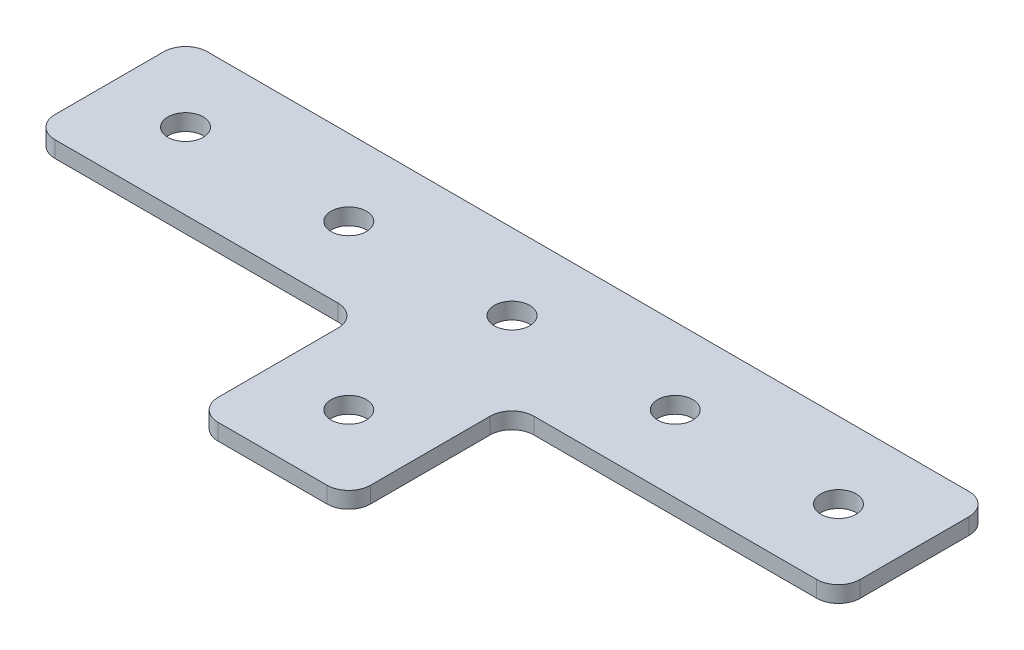
ISO-10303-21;
HEADER;
FILE_DESCRIPTION(('STEP AP214'),'2;1');
FILE_NAME('part.step','',(''),(''),'','','');
FILE_SCHEMA(('AUTOMOTIVE_DESIGN { 1 0 10303 214 1 1 1 1 }'));
ENDSEC;
DATA;
#1=APPLICATION_CONTEXT('core data for automotive mechanical design processes');
#2=APPLICATION_PROTOCOL_DEFINITION('international standard','automotive_design',2000,#1);
#3=PRODUCT_CONTEXT('',#1,'mechanical');
#4=PRODUCT('Part','Part','',(#3));
#5=PRODUCT_RELATED_PRODUCT_CATEGORY('part','',(#4));
#6=PRODUCT_DEFINITION_FORMATION('','',#4);
#7=PRODUCT_DEFINITION_CONTEXT('part definition',#1,'design');
#8=PRODUCT_DEFINITION('design','',#6,#7);
#9=PRODUCT_DEFINITION_SHAPE('','',#8);
#10=(LENGTH_UNIT() NAMED_UNIT(*) SI_UNIT(.MILLI.,.METRE.));
#11=(NAMED_UNIT(*) PLANE_ANGLE_UNIT() SI_UNIT($,.RADIAN.));
#12=(NAMED_UNIT(*) SI_UNIT($,.STERADIAN.) SOLID_ANGLE_UNIT());
#13=UNCERTAINTY_MEASURE_WITH_UNIT(LENGTH_MEASURE(1.E-05),#10,'distance_accuracy_value','');
#14=(GEOMETRIC_REPRESENTATION_CONTEXT(3) GLOBAL_UNCERTAINTY_ASSIGNED_CONTEXT((#13)) GLOBAL_UNIT_ASSIGNED_CONTEXT((#10,
#11,#12)) REPRESENTATION_CONTEXT('',''));
#15=CARTESIAN_POINT('',(0.,0.,0.));
#16=DIRECTION('',(0.,0.,1.));
#17=DIRECTION('',(1.,0.,0.));
#18=AXIS2_PLACEMENT_3D('',#15,#16,#17);
#19=CARTESIAN_POINT('',(-1.3162117550678,1.30807034319605,-8.24152412122426));
#20=DIRECTION('',(0.,-1.,0.));
#21=DIRECTION('',(0.,0.,-1.));
#22=AXIS2_PLACEMENT_3D('',#19,#20,#21);
#23=PLANE('',#22);
#24=CARTESIAN_POINT('',(-1.3162117550678,1.30807034319605,-8.24152412122426));
#25=DIRECTION('',(0.,1.,0.));
#26=DIRECTION('',(0.,0.,1.));
#27=AXIS2_PLACEMENT_3D('',#24,#25,#26);
#28=CIRCLE('',#27,1.625);
#29=CARTESIAN_POINT('',(-1.3162117550678,1.30807034319605,-6.61652412122426));
#30=VERTEX_POINT('',#29);
#31=EDGE_CURVE('E276',#30,#30,#28,.T.);
#32=ORIENTED_EDGE('',*,*,#31,.T.);
#33=EDGE_LOOP('',(#32));
#34=FACE_BOUND('',#33,.T.);
#35=DIRECTION('',(0.,0.,-1.));
#36=VECTOR('',#35,1.);
#37=CARTESIAN_POINT('',(5.6837882449323,1.30807034319605,13.7584758787757));
#38=LINE('',#37,#36);
#39=CARTESIAN_POINT('',(5.6837882449323,1.30807034319605,11.7584758787757));
#40=VERTEX_POINT('',#39);
#41=CARTESIAN_POINT('',(5.6837882449323,1.30807034319605,0.758475878775776));
#42=VERTEX_POINT('',#41);
#43=EDGE_CURVE('E158',#40,#42,#38,.T.);
#44=ORIENTED_EDGE('',*,*,#43,.F.);
#45=CARTESIAN_POINT('',(3.6837882449323,1.30807034319605,11.7584758787757));
#46=DIRECTION('',(0.,-1.,0.));
#47=DIRECTION('',(0.,0.,-1.));
#48=AXIS2_PLACEMENT_3D('',#45,#46,#47);
#49=CIRCLE('',#48,2.);
#50=CARTESIAN_POINT('',(3.6837882449323,1.30807034319605,13.7584758787757));
#51=VERTEX_POINT('',#50);
#52=EDGE_CURVE('E187',#40,#51,#49,.T.);
#53=ORIENTED_EDGE('',*,*,#52,.T.);
#54=DIRECTION('',(1.,0.,0.));
#55=VECTOR('',#54,1.);
#56=CARTESIAN_POINT('',(-8.31621175506789,1.30807034319605,13.7584758787757));
#57=LINE('',#56,#55);
#58=CARTESIAN_POINT('',(-6.31621175506789,1.30807034319605,13.7584758787757));
#59=VERTEX_POINT('',#58);
#60=EDGE_CURVE('E162',#59,#51,#57,.T.);
#61=ORIENTED_EDGE('',*,*,#60,.F.);
#62=CARTESIAN_POINT('',(-6.31621175506789,1.30807034319605,11.7584758787757));
#63=DIRECTION('',(0.,-1.,0.));
#64=DIRECTION('',(0.,0.,-1.));
#65=AXIS2_PLACEMENT_3D('',#62,#63,#64);
#66=CIRCLE('',#65,2.);
#67=CARTESIAN_POINT('',(-8.31621175506789,1.30807034319605,11.7584758787757));
#68=VERTEX_POINT('',#67);
#69=EDGE_CURVE('E157',#59,#68,#66,.T.);
#70=ORIENTED_EDGE('',*,*,#69,.T.);
#71=DIRECTION('',(0.,0.,-1.));
#72=VECTOR('',#71,1.);
#73=CARTESIAN_POINT('',(-8.31621175506789,1.30807034319605,13.7584758787757));
#74=LINE('',#73,#72);
#75=CARTESIAN_POINT('',(-8.31621175506789,1.30807034319605,0.758475878775778));
#76=VERTEX_POINT('',#75);
#77=EDGE_CURVE('E240',#68,#76,#74,.T.);
#78=ORIENTED_EDGE('',*,*,#77,.T.);
#79=CARTESIAN_POINT('',(-10.3162117550679,1.30807034319605,0.758475878775778));
#80=DIRECTION('',(0.,-1.,0.));
#81=DIRECTION('',(0.,0.,-1.));
#82=AXIS2_PLACEMENT_3D('',#79,#80,#81);
#83=CIRCLE('',#82,2.);
#84=CARTESIAN_POINT('',(-10.3162117550679,1.30807034319605,-1.24152412122422));
#85=VERTEX_POINT('',#84);
#86=EDGE_CURVE('E10',#76,#85,#83,.F.);
#87=ORIENTED_EDGE('',*,*,#86,.T.);
#88=DIRECTION('',(-1.,0.,0.));
#89=VECTOR('',#88,1.);
#90=CARTESIAN_POINT('',(-8.31621175506789,1.30807034319605,-1.24152412122422));
#91=LINE('',#90,#89);
#92=CARTESIAN_POINT('',(-36.3162117550677,1.30807034319605,-1.24152412122422));
#93=VERTEX_POINT('',#92);
#94=EDGE_CURVE('E230',#85,#93,#91,.T.);
#95=ORIENTED_EDGE('',*,*,#94,.T.);
#96=CARTESIAN_POINT('',(-36.3162117550677,1.30807034319605,-3.24152412122422));
#97=DIRECTION('',(0.,-1.,0.));
#98=DIRECTION('',(0.,0.,-1.));
#99=AXIS2_PLACEMENT_3D('',#96,#97,#98);
#100=CIRCLE('',#99,2.);
#101=CARTESIAN_POINT('',(-38.3162117550677,1.30807034319605,-3.24152412122421));
#102=VERTEX_POINT('',#101);
#103=EDGE_CURVE('E179',#93,#102,#100,.T.);
#104=ORIENTED_EDGE('',*,*,#103,.T.);
#105=DIRECTION('',(0.,0.,-1.));
#106=VECTOR('',#105,1.);
#107=CARTESIAN_POINT('',(-38.3162117550677,1.30807034319605,-1.24152412122422));
#108=LINE('',#107,#106);
#109=CARTESIAN_POINT('',(-38.3162117550677,1.30807034319605,-13.2415241212243));
#110=VERTEX_POINT('',#109);
#111=EDGE_CURVE('E244',#102,#110,#108,.T.);
#112=ORIENTED_EDGE('',*,*,#111,.T.);
#113=CARTESIAN_POINT('',(-36.3162117550677,1.30807034319605,-13.2415241212243));
#114=DIRECTION('',(0.,-1.,0.));
#115=DIRECTION('',(0.,0.,-1.));
#116=AXIS2_PLACEMENT_3D('',#113,#114,#115);
#117=CIRCLE('',#116,2.);
#118=CARTESIAN_POINT('',(-36.3162117550677,1.30807034319605,-15.2415241212243));
#119=VERTEX_POINT('',#118);
#120=EDGE_CURVE('E182',#110,#119,#117,.T.);
#121=ORIENTED_EDGE('',*,*,#120,.T.);
#122=DIRECTION('',(-1.,0.,0.));
#123=VECTOR('',#122,1.);
#124=CARTESIAN_POINT('',(35.6837882449321,1.30807034319605,-15.2415241212243));
#125=LINE('',#124,#123);
#126=CARTESIAN_POINT('',(33.6837882449321,1.30807034319605,-15.2415241212243));
#127=VERTEX_POINT('',#126);
#128=EDGE_CURVE('E287',#127,#119,#125,.T.);
#129=ORIENTED_EDGE('',*,*,#128,.F.);
#130=CARTESIAN_POINT('',(33.6837882449321,1.30807034319605,-13.2415241212243));
#131=DIRECTION('',(0.,-1.,0.));
#132=DIRECTION('',(0.,0.,-1.));
#133=AXIS2_PLACEMENT_3D('',#130,#131,#132);
#134=CIRCLE('',#133,2.);
#135=CARTESIAN_POINT('',(35.6837882449321,1.30807034319605,-13.2415241212243));
#136=VERTEX_POINT('',#135);
#137=EDGE_CURVE('E184',#127,#136,#134,.T.);
#138=ORIENTED_EDGE('',*,*,#137,.T.);
#139=DIRECTION('',(0.,0.,-1.));
#140=VECTOR('',#139,1.);
#141=CARTESIAN_POINT('',(35.6837882449321,1.30807034319605,-1.24152412122422));
#142=LINE('',#141,#140);
#143=CARTESIAN_POINT('',(35.6837882449321,1.30807034319605,-3.24152412122422));
#144=VERTEX_POINT('',#143);
#145=EDGE_CURVE('E284',#144,#136,#142,.T.);
#146=ORIENTED_EDGE('',*,*,#145,.F.);
#147=CARTESIAN_POINT('',(33.6837882449321,1.30807034319605,-3.24152412122422));
#148=DIRECTION('',(0.,-1.,0.));
#149=DIRECTION('',(0.,0.,-1.));
#150=AXIS2_PLACEMENT_3D('',#147,#148,#149);
#151=CIRCLE('',#150,2.);
#152=CARTESIAN_POINT('',(33.6837882449321,1.30807034319605,-1.24152412122422));
#153=VERTEX_POINT('',#152);
#154=EDGE_CURVE('E31',#144,#153,#151,.T.);
#155=ORIENTED_EDGE('',*,*,#154,.T.);
#156=DIRECTION('',(1.,0.,0.));
#157=VECTOR('',#156,1.);
#158=CARTESIAN_POINT('',(5.6837882449323,1.30807034319605,-1.24152412122422));
#159=LINE('',#158,#157);
#160=CARTESIAN_POINT('',(7.6837882449323,1.30807034319605,-1.24152412122422));
#161=VERTEX_POINT('',#160);
#162=EDGE_CURVE('E282',#161,#153,#159,.T.);
#163=ORIENTED_EDGE('',*,*,#162,.F.);
#164=CARTESIAN_POINT('',(7.6837882449323,1.30807034319605,0.758475878775776));
#165=DIRECTION('',(0.,-1.,0.));
#166=DIRECTION('',(0.,0.,-1.));
#167=AXIS2_PLACEMENT_3D('',#164,#165,#166);
#168=CIRCLE('',#167,2.);
#169=EDGE_CURVE('E219',#161,#42,#168,.F.);
#170=ORIENTED_EDGE('',*,*,#169,.T.);
#171=EDGE_LOOP('',(#44,#53,#61,#70,#78,#87,#95,#104,#112,#121,#129,#138,#146,#155,#163,#170));
#172=FACE_BOUND('',#171,.T.);
#173=CARTESIAN_POINT('',(-1.31621175506781,1.30807034319605,6.75847587877574));
#174=DIRECTION('',(0.,1.,0.));
#175=DIRECTION('',(0.,0.,1.));
#176=AXIS2_PLACEMENT_3D('',#173,#174,#175);
#177=CIRCLE('',#176,1.625);
#178=CARTESIAN_POINT('',(-1.31621175506781,1.30807034319605,8.38347587877574));
#179=VERTEX_POINT('',#178);
#180=EDGE_CURVE('E264',#179,#179,#177,.T.);
#181=ORIENTED_EDGE('',*,*,#180,.T.);
#182=EDGE_LOOP('',(#181));
#183=FACE_BOUND('',#182,.T.);
#184=CARTESIAN_POINT('',(28.6837882449322,1.30807034319605,-8.24152412122426));
#185=DIRECTION('',(0.,1.,0.));
#186=DIRECTION('',(0.,0.,1.));
#187=AXIS2_PLACEMENT_3D('',#184,#185,#186);
#188=CIRCLE('',#187,1.625);
#189=CARTESIAN_POINT('',(28.6837882449322,1.30807034319605,-6.61652412122426));
#190=VERTEX_POINT('',#189);
#191=EDGE_CURVE('E258',#190,#190,#188,.T.);
#192=ORIENTED_EDGE('',*,*,#191,.T.);
#193=EDGE_LOOP('',(#192));
#194=FACE_BOUND('',#193,.T.);
#195=CARTESIAN_POINT('',(13.6837882449322,1.30807034319605,-8.24152412122425));
#196=DIRECTION('',(0.,1.,0.));
#197=DIRECTION('',(0.,0.,1.));
#198=AXIS2_PLACEMENT_3D('',#195,#196,#197);
#199=CIRCLE('',#198,1.625);
#200=CARTESIAN_POINT('',(13.6837882449322,1.30807034319605,-6.61652412122425));
#201=VERTEX_POINT('',#200);
#202=EDGE_CURVE('E270',#201,#201,#199,.T.);
#203=ORIENTED_EDGE('',*,*,#202,.T.);
#204=EDGE_LOOP('',(#203));
#205=FACE_BOUND('',#204,.T.);
#206=CARTESIAN_POINT('',(-31.3162117550678,1.30807034319605,-8.24152412122425));
#207=DIRECTION('',(0.,-1.,0.));
#208=DIRECTION('',(0.,0.,1.));
#209=AXIS2_PLACEMENT_3D('',#206,#207,#208);
#210=CIRCLE('',#209,1.625);
#211=CARTESIAN_POINT('',(-31.3162117550678,1.30807034319605,-6.61652412122425));
#212=VERTEX_POINT('',#211);
#213=EDGE_CURVE('E393',#212,#212,#210,.T.);
#214=ORIENTED_EDGE('',*,*,#213,.F.);
#215=EDGE_LOOP('',(#214));
#216=FACE_BOUND('',#215,.T.);
#217=CARTESIAN_POINT('',(-16.3162117550678,1.30807034319605,-8.24152412122425));
#218=DIRECTION('',(0.,-1.,0.));
#219=DIRECTION('',(0.,0.,1.));
#220=AXIS2_PLACEMENT_3D('',#217,#218,#219);
#221=CIRCLE('',#220,1.625);
#222=CARTESIAN_POINT('',(-16.3162117550678,1.30807034319605,-6.61652412122425));
#223=VERTEX_POINT('',#222);
#224=EDGE_CURVE('E255',#223,#223,#221,.T.);
#225=ORIENTED_EDGE('',*,*,#224,.F.);
#226=EDGE_LOOP('',(#225));
#227=FACE_BOUND('',#226,.T.);
#228=ADVANCED_FACE('F16',(#34,#172,#183,#194,#205,#216,#227),#23,.T.);
#229=CARTESIAN_POINT('',(5.6837882449323,1.30807034319605,-1.24152412122422));
#230=DIRECTION('',(0.,0.,1.));
#231=DIRECTION('',(1.,0.,0.));
#232=AXIS2_PLACEMENT_3D('',#229,#230,#231);
#233=PLANE('',#232);
#234=DIRECTION('',(1.,0.,0.));
#235=VECTOR('',#234,1.);
#236=CARTESIAN_POINT('',(5.6837882449323,2.80807034319605,-1.24152412122422));
#237=LINE('',#236,#235);
#238=CARTESIAN_POINT('',(7.6837882449323,2.80807034319605,-1.24152412122422));
#239=VERTEX_POINT('',#238);
#240=CARTESIAN_POINT('',(33.6837882449321,2.80807034319605,-1.24152412122422));
#241=VERTEX_POINT('',#240);
#242=EDGE_CURVE('E279',#239,#241,#237,.T.);
#243=ORIENTED_EDGE('',*,*,#242,.F.);
#244=DIRECTION('',(0.,1.,0.));
#245=VECTOR('',#244,1.);
#246=CARTESIAN_POINT('',(7.6837882449323,1.30807034319605,-1.24152412122422));
#247=LINE('',#246,#245);
#248=EDGE_CURVE('E38',#239,#161,#247,.F.);
#249=ORIENTED_EDGE('',*,*,#248,.T.);
#250=ORIENTED_EDGE('',*,*,#162,.T.);
#251=DIRECTION('',(0.,1.,0.));
#252=VECTOR('',#251,1.);
#253=CARTESIAN_POINT('',(33.6837882449321,1.30807034319605,-1.24152412122422));
#254=LINE('',#253,#252);
#255=EDGE_CURVE('E189',#153,#241,#254,.T.);
#256=ORIENTED_EDGE('',*,*,#255,.T.);
#257=EDGE_LOOP('',(#243,#249,#250,#256));
#258=FACE_BOUND('',#257,.T.);
#259=ADVANCED_FACE('F315',(#258),#233,.T.);
#260=CARTESIAN_POINT('',(5.6837882449323,1.30807034319605,13.7584758787757));
#261=DIRECTION('',(1.,0.,0.));
#262=DIRECTION('',(0.,0.,-1.));
#263=AXIS2_PLACEMENT_3D('',#260,#261,#262);
#264=PLANE('',#263);
#265=DIRECTION('',(0.,0.,-1.));
#266=VECTOR('',#265,1.);
#267=CARTESIAN_POINT('',(5.6837882449323,2.80807034319605,13.7584758787757));
#268=LINE('',#267,#266);
#269=CARTESIAN_POINT('',(5.6837882449323,2.80807034319605,11.7584758787757));
#270=VERTEX_POINT('',#269);
#271=CARTESIAN_POINT('',(5.6837882449323,2.80807034319605,0.758475878775776));
#272=VERTEX_POINT('',#271);
#273=EDGE_CURVE('E152',#270,#272,#268,.T.);
#274=ORIENTED_EDGE('',*,*,#273,.F.);
#275=DIRECTION('',(0.,1.,0.));
#276=VECTOR('',#275,1.);
#277=CARTESIAN_POINT('',(5.6837882449323,1.30807034319605,11.7584758787757));
#278=LINE('',#277,#276);
#279=EDGE_CURVE('E177',#270,#40,#278,.F.);
#280=ORIENTED_EDGE('',*,*,#279,.T.);
#281=ORIENTED_EDGE('',*,*,#43,.T.);
#282=DIRECTION('',(0.,1.,0.));
#283=VECTOR('',#282,1.);
#284=CARTESIAN_POINT('',(5.6837882449323,2.80807034319605,0.758475878775776));
#285=LINE('',#284,#283);
#286=EDGE_CURVE('E174',#42,#272,#285,.T.);
#287=ORIENTED_EDGE('',*,*,#286,.T.);
#288=EDGE_LOOP('',(#274,#280,#281,#287));
#289=FACE_BOUND('',#288,.T.);
#290=ADVANCED_FACE('F323',(#289),#264,.T.);
#291=CARTESIAN_POINT('',(-8.31621175506789,1.30807034319605,13.7584758787757));
#292=DIRECTION('',(0.,0.,1.));
#293=DIRECTION('',(1.,0.,0.));
#294=AXIS2_PLACEMENT_3D('',#291,#292,#293);
#295=PLANE('',#294);
#296=ORIENTED_EDGE('',*,*,#60,.T.);
#297=DIRECTION('',(0.,1.,0.));
#298=VECTOR('',#297,1.);
#299=CARTESIAN_POINT('',(3.6837882449323,1.30807034319605,13.7584758787757));
#300=LINE('',#299,#298);
#301=CARTESIAN_POINT('',(3.6837882449323,2.80807034319605,13.7584758787757));
#302=VERTEX_POINT('',#301);
#303=EDGE_CURVE('E151',#51,#302,#300,.T.);
#304=ORIENTED_EDGE('',*,*,#303,.T.);
#305=DIRECTION('',(1.,0.,0.));
#306=VECTOR('',#305,1.);
#307=CARTESIAN_POINT('',(-8.31621175506789,2.80807034319605,13.7584758787757));
#308=LINE('',#307,#306);
#309=CARTESIAN_POINT('',(-6.31621175506789,2.80807034319605,13.7584758787757));
#310=VERTEX_POINT('',#309);
#311=EDGE_CURVE('E134',#310,#302,#308,.T.);
#312=ORIENTED_EDGE('',*,*,#311,.F.);
#313=DIRECTION('',(0.,1.,0.));
#314=VECTOR('',#313,1.);
#315=CARTESIAN_POINT('',(-6.31621175506789,1.30807034319605,13.7584758787757));
#316=LINE('',#315,#314);
#317=EDGE_CURVE('E148',#310,#59,#316,.F.);
#318=ORIENTED_EDGE('',*,*,#317,.T.);
#319=EDGE_LOOP('',(#296,#304,#312,#318));
#320=FACE_BOUND('',#319,.T.);
#321=ADVANCED_FACE('F147',(#320),#295,.T.);
#322=CARTESIAN_POINT('',(35.6837882449321,1.30807034319605,-15.2415241212243));
#323=DIRECTION('',(0.,0.,-1.));
#324=DIRECTION('',(-1.,0.,0.));
#325=AXIS2_PLACEMENT_3D('',#322,#323,#324);
#326=PLANE('',#325);
#327=DIRECTION('',(-1.,0.,0.));
#328=VECTOR('',#327,1.);
#329=CARTESIAN_POINT('',(35.6837882449321,2.80807034319605,-15.2415241212243));
#330=LINE('',#329,#328);
#331=CARTESIAN_POINT('',(33.6837882449321,2.80807034319605,-15.2415241212243));
#332=VERTEX_POINT('',#331);
#333=CARTESIAN_POINT('',(-36.3162117550677,2.80807034319605,-15.2415241212243));
#334=VERTEX_POINT('',#333);
#335=EDGE_CURVE('E153',#332,#334,#330,.T.);
#336=ORIENTED_EDGE('',*,*,#335,.F.);
#337=DIRECTION('',(0.,1.,0.));
#338=VECTOR('',#337,1.);
#339=CARTESIAN_POINT('',(33.6837882449321,1.30807034319605,-15.2415241212243));
#340=LINE('',#339,#338);
#341=EDGE_CURVE('E201',#332,#127,#340,.F.);
#342=ORIENTED_EDGE('',*,*,#341,.T.);
#343=ORIENTED_EDGE('',*,*,#128,.T.);
#344=DIRECTION('',(0.,1.,0.));
#345=VECTOR('',#344,1.);
#346=CARTESIAN_POINT('',(-36.3162117550677,1.30807034319605,-15.2415241212243));
#347=LINE('',#346,#345);
#348=EDGE_CURVE('E198',#119,#334,#347,.T.);
#349=ORIENTED_EDGE('',*,*,#348,.T.);
#350=EDGE_LOOP('',(#336,#342,#343,#349));
#351=FACE_BOUND('',#350,.T.);
#352=ADVANCED_FACE('F301',(#351),#326,.T.);
#353=CARTESIAN_POINT('',(35.6837882449321,1.30807034319605,-1.24152412122422));
#354=DIRECTION('',(1.,0.,0.));
#355=DIRECTION('',(0.,0.,-1.));
#356=AXIS2_PLACEMENT_3D('',#353,#354,#355);
#357=PLANE('',#356);
#358=DIRECTION('',(0.,0.,-1.));
#359=VECTOR('',#358,1.);
#360=CARTESIAN_POINT('',(35.6837882449321,2.80807034319605,-1.24152412122422));
#361=LINE('',#360,#359);
#362=CARTESIAN_POINT('',(35.6837882449321,2.80807034319605,-3.24152412122422));
#363=VERTEX_POINT('',#362);
#364=CARTESIAN_POINT('',(35.6837882449321,2.80807034319605,-13.2415241212243));
#365=VERTEX_POINT('',#364);
#366=EDGE_CURVE('E293',#363,#365,#361,.T.);
#367=ORIENTED_EDGE('',*,*,#366,.F.);
#368=DIRECTION('',(0.,1.,0.));
#369=VECTOR('',#368,1.);
#370=CARTESIAN_POINT('',(35.6837882449321,1.30807034319605,-3.24152412122422));
#371=LINE('',#370,#369);
#372=EDGE_CURVE('E196',#363,#144,#371,.F.);
#373=ORIENTED_EDGE('',*,*,#372,.T.);
#374=ORIENTED_EDGE('',*,*,#145,.T.);
#375=DIRECTION('',(0.,1.,0.));
#376=VECTOR('',#375,1.);
#377=CARTESIAN_POINT('',(35.6837882449321,1.30807034319605,-13.2415241212243));
#378=LINE('',#377,#376);
#379=EDGE_CURVE('E193',#136,#365,#378,.T.);
#380=ORIENTED_EDGE('',*,*,#379,.T.);
#381=EDGE_LOOP('',(#367,#373,#374,#380));
#382=FACE_BOUND('',#381,.T.);
#383=ADVANCED_FACE('F310',(#382),#357,.T.);
#384=CARTESIAN_POINT('',(-1.3162117550678,2.80807034319605,-8.24152412122426));
#385=DIRECTION('',(0.,-1.,0.));
#386=DIRECTION('',(0.,0.,-1.));
#387=AXIS2_PLACEMENT_3D('',#384,#385,#386);
#388=PLANE('',#387);
#389=CARTESIAN_POINT('',(-1.3162117550678,2.80807034319605,-8.24152412122426));
#390=DIRECTION('',(0.,1.,0.));
#391=DIRECTION('',(0.,0.,1.));
#392=AXIS2_PLACEMENT_3D('',#389,#390,#391);
#393=CIRCLE('',#392,1.625);
#394=CARTESIAN_POINT('',(-1.3162117550678,2.80807034319605,-6.61652412122426));
#395=VERTEX_POINT('',#394);
#396=EDGE_CURVE('E273',#395,#395,#393,.T.);
#397=ORIENTED_EDGE('',*,*,#396,.F.);
#398=EDGE_LOOP('',(#397));
#399=FACE_BOUND('',#398,.T.);
#400=ORIENTED_EDGE('',*,*,#311,.T.);
#401=CARTESIAN_POINT('',(3.6837882449323,2.80807034319605,11.7584758787757));
#402=DIRECTION('',(0.,-1.,0.));
#403=DIRECTION('',(0.,0.,-1.));
#404=AXIS2_PLACEMENT_3D('',#401,#402,#403);
#405=CIRCLE('',#404,2.);
#406=EDGE_CURVE('E172',#302,#270,#405,.F.);
#407=ORIENTED_EDGE('',*,*,#406,.T.);
#408=ORIENTED_EDGE('',*,*,#273,.T.);
#409=CARTESIAN_POINT('',(7.6837882449323,2.80807034319605,0.758475878775776));
#410=DIRECTION('',(0.,-1.,0.));
#411=DIRECTION('',(0.,0.,-1.));
#412=AXIS2_PLACEMENT_3D('',#409,#410,#411);
#413=CIRCLE('',#412,2.);
#414=EDGE_CURVE('E217',#272,#239,#413,.T.);
#415=ORIENTED_EDGE('',*,*,#414,.T.);
#416=ORIENTED_EDGE('',*,*,#242,.T.);
#417=CARTESIAN_POINT('',(33.6837882449321,2.80807034319605,-3.24152412122422));
#418=DIRECTION('',(0.,-1.,0.));
#419=DIRECTION('',(0.,0.,-1.));
#420=AXIS2_PLACEMENT_3D('',#417,#418,#419);
#421=CIRCLE('',#420,2.);
#422=EDGE_CURVE('E170',#241,#363,#421,.F.);
#423=ORIENTED_EDGE('',*,*,#422,.T.);
#424=ORIENTED_EDGE('',*,*,#366,.T.);
#425=CARTESIAN_POINT('',(33.6837882449321,2.80807034319605,-13.2415241212243));
#426=DIRECTION('',(0.,-1.,0.));
#427=DIRECTION('',(0.,0.,-1.));
#428=AXIS2_PLACEMENT_3D('',#425,#426,#427);
#429=CIRCLE('',#428,2.);
#430=EDGE_CURVE('E168',#365,#332,#429,.F.);
#431=ORIENTED_EDGE('',*,*,#430,.T.);
#432=ORIENTED_EDGE('',*,*,#335,.T.);
#433=CARTESIAN_POINT('',(-36.3162117550677,2.80807034319605,-13.2415241212243));
#434=DIRECTION('',(0.,-1.,0.));
#435=DIRECTION('',(0.,0.,-1.));
#436=AXIS2_PLACEMENT_3D('',#433,#434,#435);
#437=CIRCLE('',#436,2.);
#438=CARTESIAN_POINT('',(-38.3162117550677,2.80807034319605,-13.2415241212243));
#439=VERTEX_POINT('',#438);
#440=EDGE_CURVE('E141',#334,#439,#437,.F.);
#441=ORIENTED_EDGE('',*,*,#440,.T.);
#442=DIRECTION('',(0.,0.,-1.));
#443=VECTOR('',#442,1.);
#444=CARTESIAN_POINT('',(-38.3162117550677,2.80807034319605,-1.24152412122422));
#445=LINE('',#444,#443);
#446=CARTESIAN_POINT('',(-38.3162117550677,2.80807034319605,-3.24152412122421));
#447=VERTEX_POINT('',#446);
#448=EDGE_CURVE('E231',#447,#439,#445,.T.);
#449=ORIENTED_EDGE('',*,*,#448,.F.);
#450=CARTESIAN_POINT('',(-36.3162117550677,2.80807034319605,-3.24152412122422));
#451=DIRECTION('',(0.,-1.,0.));
#452=DIRECTION('',(0.,0.,-1.));
#453=AXIS2_PLACEMENT_3D('',#450,#451,#452);
#454=CIRCLE('',#453,2.);
#455=CARTESIAN_POINT('',(-36.3162117550677,2.80807034319605,-1.24152412122422));
#456=VERTEX_POINT('',#455);
#457=EDGE_CURVE('E142',#447,#456,#454,.F.);
#458=ORIENTED_EDGE('',*,*,#457,.T.);
#459=DIRECTION('',(-1.,0.,0.));
#460=VECTOR('',#459,1.);
#461=CARTESIAN_POINT('',(-8.31621175506789,2.80807034319605,-1.24152412122422));
#462=LINE('',#461,#460);
#463=CARTESIAN_POINT('',(-10.3162117550679,2.80807034319605,-1.24152412122422));
#464=VERTEX_POINT('',#463);
#465=EDGE_CURVE('E222',#464,#456,#462,.T.);
#466=ORIENTED_EDGE('',*,*,#465,.F.);
#467=CARTESIAN_POINT('',(-10.3162117550679,2.80807034319605,0.758475878775778));
#468=DIRECTION('',(0.,-1.,0.));
#469=DIRECTION('',(0.,0.,-1.));
#470=AXIS2_PLACEMENT_3D('',#467,#468,#469);
#471=CIRCLE('',#470,2.);
#472=CARTESIAN_POINT('',(-8.31621175506789,2.80807034319605,0.758475878775778));
#473=VERTEX_POINT('',#472);
#474=EDGE_CURVE('E24',#464,#473,#471,.T.);
#475=ORIENTED_EDGE('',*,*,#474,.T.);
#476=DIRECTION('',(0.,0.,-1.));
#477=VECTOR('',#476,1.);
#478=CARTESIAN_POINT('',(-8.31621175506789,2.80807034319605,13.7584758787757));
#479=LINE('',#478,#477);
#480=CARTESIAN_POINT('',(-8.31621175506789,2.80807034319605,11.7584758787757));
#481=VERTEX_POINT('',#480);
#482=EDGE_CURVE('E136',#481,#473,#479,.T.);
#483=ORIENTED_EDGE('',*,*,#482,.F.);
#484=CARTESIAN_POINT('',(-6.31621175506789,2.80807034319605,11.7584758787757));
#485=DIRECTION('',(0.,-1.,0.));
#486=DIRECTION('',(0.,0.,-1.));
#487=AXIS2_PLACEMENT_3D('',#484,#485,#486);
#488=CIRCLE('',#487,2.);
#489=EDGE_CURVE('E130',#481,#310,#488,.F.);
#490=ORIENTED_EDGE('',*,*,#489,.T.);
#491=EDGE_LOOP('',(#400,#407,#408,#415,#416,#423,#424,#431,#432,#441,#449,#458,#466,#475,#483,#490));
#492=FACE_BOUND('',#491,.T.);
#493=CARTESIAN_POINT('',(28.6837882449322,2.80807034319605,-8.24152412122426));
#494=DIRECTION('',(0.,1.,0.));
#495=DIRECTION('',(0.,0.,1.));
#496=AXIS2_PLACEMENT_3D('',#493,#494,#495);
#497=CIRCLE('',#496,1.625);
#498=CARTESIAN_POINT('',(28.6837882449322,2.80807034319605,-6.61652412122426));
#499=VERTEX_POINT('',#498);
#500=EDGE_CURVE('E253',#499,#499,#497,.T.);
#501=ORIENTED_EDGE('',*,*,#500,.F.);
#502=EDGE_LOOP('',(#501));
#503=FACE_BOUND('',#502,.T.);
#504=CARTESIAN_POINT('',(13.6837882449322,2.80807034319605,-8.24152412122425));
#505=DIRECTION('',(0.,1.,0.));
#506=DIRECTION('',(0.,0.,1.));
#507=AXIS2_PLACEMENT_3D('',#504,#505,#506);
#508=CIRCLE('',#507,1.625);
#509=CARTESIAN_POINT('',(13.6837882449322,2.80807034319605,-6.61652412122425));
#510=VERTEX_POINT('',#509);
#511=EDGE_CURVE('E267',#510,#510,#508,.T.);
#512=ORIENTED_EDGE('',*,*,#511,.F.);
#513=EDGE_LOOP('',(#512));
#514=FACE_BOUND('',#513,.T.);
#515=CARTESIAN_POINT('',(-1.31621175506781,2.80807034319605,6.75847587877574));
#516=DIRECTION('',(0.,1.,0.));
#517=DIRECTION('',(0.,0.,1.));
#518=AXIS2_PLACEMENT_3D('',#515,#516,#517);
#519=CIRCLE('',#518,1.625);
#520=CARTESIAN_POINT('',(-1.31621175506781,2.80807034319605,8.38347587877574));
#521=VERTEX_POINT('',#520);
#522=EDGE_CURVE('E261',#521,#521,#519,.T.);
#523=ORIENTED_EDGE('',*,*,#522,.F.);
#524=EDGE_LOOP('',(#523));
#525=FACE_BOUND('',#524,.T.);
#526=CARTESIAN_POINT('',(-31.3162117550678,2.80807034319605,-8.24152412122425));
#527=DIRECTION('',(0.,-1.,0.));
#528=DIRECTION('',(0.,0.,1.));
#529=AXIS2_PLACEMENT_3D('',#526,#527,#528);
#530=CIRCLE('',#529,1.625);
#531=CARTESIAN_POINT('',(-31.3162117550678,2.80807034319605,-6.61652412122425));
#532=VERTEX_POINT('',#531);
#533=EDGE_CURVE('E395',#532,#532,#530,.T.);
#534=ORIENTED_EDGE('',*,*,#533,.T.);
#535=EDGE_LOOP('',(#534));
#536=FACE_BOUND('',#535,.T.);
#537=CARTESIAN_POINT('',(-16.3162117550678,2.80807034319605,-8.24152412122425));
#538=DIRECTION('',(0.,-1.,0.));
#539=DIRECTION('',(0.,0.,1.));
#540=AXIS2_PLACEMENT_3D('',#537,#538,#539);
#541=CIRCLE('',#540,1.625);
#542=CARTESIAN_POINT('',(-16.3162117550678,2.80807034319605,-6.61652412122425));
#543=VERTEX_POINT('',#542);
#544=EDGE_CURVE('E249',#543,#543,#541,.T.);
#545=ORIENTED_EDGE('',*,*,#544,.T.);
#546=EDGE_LOOP('',(#545));
#547=FACE_BOUND('',#546,.T.);
#548=ADVANCED_FACE('F132',(#399,#492,#503,#514,#525,#536,#547),#388,.F.);
#549=CARTESIAN_POINT('',(-1.3162117550678,1.30807034319605,-8.24152412122426));
#550=DIRECTION('',(0.,1.,0.));
#551=DIRECTION('',(0.,0.,1.));
#552=AXIS2_PLACEMENT_3D('',#549,#550,#551);
#553=CYLINDRICAL_SURFACE('',#552,1.625);
#554=ORIENTED_EDGE('',*,*,#31,.F.);
#555=EDGE_LOOP('',(#554));
#556=FACE_BOUND('',#555,.T.);
#557=ORIENTED_EDGE('',*,*,#396,.T.);
#558=EDGE_LOOP('',(#557));
#559=FACE_BOUND('',#558,.T.);
#560=ADVANCED_FACE('F349',(#556,#559),#553,.F.);
#561=CARTESIAN_POINT('',(13.6837882449322,1.30807034319605,-8.24152412122425));
#562=DIRECTION('',(0.,1.,0.));
#563=DIRECTION('',(0.,0.,1.));
#564=AXIS2_PLACEMENT_3D('',#561,#562,#563);
#565=CYLINDRICAL_SURFACE('',#564,1.625);
#566=ORIENTED_EDGE('',*,*,#202,.F.);
#567=EDGE_LOOP('',(#566));
#568=FACE_BOUND('',#567,.T.);
#569=ORIENTED_EDGE('',*,*,#511,.T.);
#570=EDGE_LOOP('',(#569));
#571=FACE_BOUND('',#570,.T.);
#572=ADVANCED_FACE('F362',(#568,#571),#565,.F.);
#573=CARTESIAN_POINT('',(-1.31621175506781,1.30807034319605,6.75847587877574));
#574=DIRECTION('',(0.,1.,0.));
#575=DIRECTION('',(0.,0.,1.));
#576=AXIS2_PLACEMENT_3D('',#573,#574,#575);
#577=CYLINDRICAL_SURFACE('',#576,1.625);
#578=ORIENTED_EDGE('',*,*,#522,.T.);
#579=EDGE_LOOP('',(#578));
#580=FACE_BOUND('',#579,.T.);
#581=ORIENTED_EDGE('',*,*,#180,.F.);
#582=EDGE_LOOP('',(#581));
#583=FACE_BOUND('',#582,.T.);
#584=ADVANCED_FACE('F366',(#580,#583),#577,.F.);
#585=CARTESIAN_POINT('',(28.6837882449322,1.30807034319605,-8.24152412122426));
#586=DIRECTION('',(0.,1.,0.));
#587=DIRECTION('',(0.,0.,1.));
#588=AXIS2_PLACEMENT_3D('',#585,#586,#587);
#589=CYLINDRICAL_SURFACE('',#588,1.625);
#590=ORIENTED_EDGE('',*,*,#191,.F.);
#591=EDGE_LOOP('',(#590));
#592=FACE_BOUND('',#591,.T.);
#593=ORIENTED_EDGE('',*,*,#500,.T.);
#594=EDGE_LOOP('',(#593));
#595=FACE_BOUND('',#594,.T.);
#596=ADVANCED_FACE('F370',(#592,#595),#589,.F.);
#597=CARTESIAN_POINT('',(-8.31621175506789,1.30807034319605,-1.24152412122422));
#598=DIRECTION('',(0.,0.,1.));
#599=DIRECTION('',(-1.,0.,0.));
#600=AXIS2_PLACEMENT_3D('',#597,#598,#599);
#601=PLANE('',#600);
#602=ORIENTED_EDGE('',*,*,#94,.F.);
#603=DIRECTION('',(0.,1.,0.));
#604=VECTOR('',#603,1.);
#605=CARTESIAN_POINT('',(-10.3162117550679,2.80807034319605,-1.24152412122422));
#606=LINE('',#605,#604);
#607=EDGE_CURVE('E210',#85,#464,#606,.T.);
#608=ORIENTED_EDGE('',*,*,#607,.T.);
#609=ORIENTED_EDGE('',*,*,#465,.T.);
#610=DIRECTION('',(0.,1.,0.));
#611=VECTOR('',#610,1.);
#612=CARTESIAN_POINT('',(-36.3162117550677,1.30807034319605,-1.24152412122422));
#613=LINE('',#612,#611);
#614=EDGE_CURVE('E208',#456,#93,#613,.F.);
#615=ORIENTED_EDGE('',*,*,#614,.T.);
#616=EDGE_LOOP('',(#602,#608,#609,#615));
#617=FACE_BOUND('',#616,.T.);
#618=ADVANCED_FACE('F242',(#617),#601,.T.);
#619=CARTESIAN_POINT('',(-8.31621175506789,1.30807034319605,13.7584758787757));
#620=DIRECTION('',(-1.,0.,0.));
#621=DIRECTION('',(0.,0.,-1.));
#622=AXIS2_PLACEMENT_3D('',#619,#620,#621);
#623=PLANE('',#622);
#624=ORIENTED_EDGE('',*,*,#482,.T.);
#625=DIRECTION('',(0.,1.,0.));
#626=VECTOR('',#625,1.);
#627=CARTESIAN_POINT('',(-8.31621175506789,1.30807034319605,0.758475878775778));
#628=LINE('',#627,#626);
#629=EDGE_CURVE('E215',#473,#76,#628,.F.);
#630=ORIENTED_EDGE('',*,*,#629,.T.);
#631=ORIENTED_EDGE('',*,*,#77,.F.);
#632=DIRECTION('',(0.,1.,0.));
#633=VECTOR('',#632,1.);
#634=CARTESIAN_POINT('',(-8.31621175506789,1.30807034319605,11.7584758787757));
#635=LINE('',#634,#633);
#636=EDGE_CURVE('E213',#68,#481,#635,.T.);
#637=ORIENTED_EDGE('',*,*,#636,.T.);
#638=EDGE_LOOP('',(#624,#630,#631,#637));
#639=FACE_BOUND('',#638,.T.);
#640=ADVANCED_FACE('F227',(#639),#623,.T.);
#641=CARTESIAN_POINT('',(-38.3162117550677,1.30807034319605,-1.24152412122422));
#642=DIRECTION('',(-1.,0.,0.));
#643=DIRECTION('',(0.,0.,-1.));
#644=AXIS2_PLACEMENT_3D('',#641,#642,#643);
#645=PLANE('',#644);
#646=ORIENTED_EDGE('',*,*,#448,.T.);
#647=DIRECTION('',(0.,1.,0.));
#648=VECTOR('',#647,1.);
#649=CARTESIAN_POINT('',(-38.3162117550677,1.30807034319605,-13.2415241212243));
#650=LINE('',#649,#648);
#651=EDGE_CURVE('E206',#439,#110,#650,.F.);
#652=ORIENTED_EDGE('',*,*,#651,.T.);
#653=ORIENTED_EDGE('',*,*,#111,.F.);
#654=DIRECTION('',(0.,1.,0.));
#655=VECTOR('',#654,1.);
#656=CARTESIAN_POINT('',(-38.3162117550677,1.30807034319605,-3.24152412122421));
#657=LINE('',#656,#655);
#658=EDGE_CURVE('E203',#102,#447,#657,.T.);
#659=ORIENTED_EDGE('',*,*,#658,.T.);
#660=EDGE_LOOP('',(#646,#652,#653,#659));
#661=FACE_BOUND('',#660,.T.);
#662=ADVANCED_FACE('F377',(#661),#645,.T.);
#663=CARTESIAN_POINT('',(-16.3162117550678,1.30807034319605,-8.24152412122425));
#664=DIRECTION('',(0.,1.,0.));
#665=DIRECTION('',(0.,0.,1.));
#666=AXIS2_PLACEMENT_3D('',#663,#664,#665);
#667=CYLINDRICAL_SURFACE('',#666,1.625);
#668=ORIENTED_EDGE('',*,*,#224,.T.);
#669=EDGE_LOOP('',(#668));
#670=FACE_BOUND('',#669,.T.);
#671=ORIENTED_EDGE('',*,*,#544,.F.);
#672=EDGE_LOOP('',(#671));
#673=FACE_BOUND('',#672,.T.);
#674=ADVANCED_FACE('F337',(#670,#673),#667,.F.);
#675=CARTESIAN_POINT('',(-31.3162117550678,1.30807034319605,-8.24152412122425));
#676=DIRECTION('',(0.,1.,0.));
#677=DIRECTION('',(0.,0.,1.));
#678=AXIS2_PLACEMENT_3D('',#675,#676,#677);
#679=CYLINDRICAL_SURFACE('',#678,1.625);
#680=ORIENTED_EDGE('',*,*,#213,.T.);
#681=EDGE_LOOP('',(#680));
#682=FACE_BOUND('',#681,.T.);
#683=ORIENTED_EDGE('',*,*,#533,.F.);
#684=EDGE_LOOP('',(#683));
#685=FACE_BOUND('',#684,.T.);
#686=ADVANCED_FACE('F329',(#682,#685),#679,.F.);
#687=CARTESIAN_POINT('',(3.6837882449323,1.30807034319605,11.7584758787757));
#688=DIRECTION('',(0.,1.,0.));
#689=DIRECTION('',(0.,0.,1.));
#690=AXIS2_PLACEMENT_3D('',#687,#688,#689);
#691=CYLINDRICAL_SURFACE('',#690,2.);
#692=ORIENTED_EDGE('',*,*,#52,.F.);
#693=ORIENTED_EDGE('',*,*,#279,.F.);
#694=ORIENTED_EDGE('',*,*,#406,.F.);
#695=ORIENTED_EDGE('',*,*,#303,.F.);
#696=EDGE_LOOP('',(#692,#693,#694,#695));
#697=FACE_BOUND('',#696,.T.);
#698=ADVANCED_FACE('F327',(#697),#691,.T.);
#699=CARTESIAN_POINT('',(7.6837882449323,1.30807034319605,0.758475878775776));
#700=DIRECTION('',(0.,-1.,0.));
#701=DIRECTION('',(0.,0.,-1.));
#702=AXIS2_PLACEMENT_3D('',#699,#700,#701);
#703=CYLINDRICAL_SURFACE('',#702,2.);
#704=ORIENTED_EDGE('',*,*,#169,.F.);
#705=ORIENTED_EDGE('',*,*,#248,.F.);
#706=ORIENTED_EDGE('',*,*,#414,.F.);
#707=ORIENTED_EDGE('',*,*,#286,.F.);
#708=EDGE_LOOP('',(#704,#705,#706,#707));
#709=FACE_BOUND('',#708,.T.);
#710=ADVANCED_FACE('F321',(#709),#703,.F.);
#711=CARTESIAN_POINT('',(33.6837882449321,1.30807034319605,-3.24152412122422));
#712=DIRECTION('',(0.,1.,0.));
#713=DIRECTION('',(0.,0.,1.));
#714=AXIS2_PLACEMENT_3D('',#711,#712,#713);
#715=CYLINDRICAL_SURFACE('',#714,2.);
#716=ORIENTED_EDGE('',*,*,#154,.F.);
#717=ORIENTED_EDGE('',*,*,#372,.F.);
#718=ORIENTED_EDGE('',*,*,#422,.F.);
#719=ORIENTED_EDGE('',*,*,#255,.F.);
#720=EDGE_LOOP('',(#716,#717,#718,#719));
#721=FACE_BOUND('',#720,.T.);
#722=ADVANCED_FACE('F313',(#721),#715,.T.);
#723=CARTESIAN_POINT('',(33.6837882449321,1.30807034319605,-13.2415241212243));
#724=DIRECTION('',(0.,1.,0.));
#725=DIRECTION('',(0.,0.,1.));
#726=AXIS2_PLACEMENT_3D('',#723,#724,#725);
#727=CYLINDRICAL_SURFACE('',#726,2.);
#728=ORIENTED_EDGE('',*,*,#137,.F.);
#729=ORIENTED_EDGE('',*,*,#341,.F.);
#730=ORIENTED_EDGE('',*,*,#430,.F.);
#731=ORIENTED_EDGE('',*,*,#379,.F.);
#732=EDGE_LOOP('',(#728,#729,#730,#731));
#733=FACE_BOUND('',#732,.T.);
#734=ADVANCED_FACE('F306',(#733),#727,.T.);
#735=CARTESIAN_POINT('',(-36.3162117550677,1.30807034319605,-13.2415241212243));
#736=DIRECTION('',(0.,1.,0.));
#737=DIRECTION('',(0.,0.,1.));
#738=AXIS2_PLACEMENT_3D('',#735,#736,#737);
#739=CYLINDRICAL_SURFACE('',#738,2.);
#740=ORIENTED_EDGE('',*,*,#120,.F.);
#741=ORIENTED_EDGE('',*,*,#651,.F.);
#742=ORIENTED_EDGE('',*,*,#440,.F.);
#743=ORIENTED_EDGE('',*,*,#348,.F.);
#744=EDGE_LOOP('',(#740,#741,#742,#743));
#745=FACE_BOUND('',#744,.T.);
#746=ADVANCED_FACE('F443',(#745),#739,.T.);
#747=CARTESIAN_POINT('',(-10.3162117550679,1.30807034319605,0.758475878775778));
#748=DIRECTION('',(0.,-1.,0.));
#749=DIRECTION('',(0.,0.,-1.));
#750=AXIS2_PLACEMENT_3D('',#747,#748,#749);
#751=CYLINDRICAL_SURFACE('',#750,2.);
#752=ORIENTED_EDGE('',*,*,#86,.F.);
#753=ORIENTED_EDGE('',*,*,#629,.F.);
#754=ORIENTED_EDGE('',*,*,#474,.F.);
#755=ORIENTED_EDGE('',*,*,#607,.F.);
#756=EDGE_LOOP('',(#752,#753,#754,#755));
#757=FACE_BOUND('',#756,.T.);
#758=ADVANCED_FACE('F234',(#757),#751,.F.);
#759=CARTESIAN_POINT('',(-6.31621175506789,1.30807034319605,11.7584758787757));
#760=DIRECTION('',(0.,1.,0.));
#761=DIRECTION('',(0.,0.,1.));
#762=AXIS2_PLACEMENT_3D('',#759,#760,#761);
#763=CYLINDRICAL_SURFACE('',#762,2.);
#764=ORIENTED_EDGE('',*,*,#69,.F.);
#765=ORIENTED_EDGE('',*,*,#317,.F.);
#766=ORIENTED_EDGE('',*,*,#489,.F.);
#767=ORIENTED_EDGE('',*,*,#636,.F.);
#768=EDGE_LOOP('',(#764,#765,#766,#767));
#769=FACE_BOUND('',#768,.T.);
#770=ADVANCED_FACE('F156',(#769),#763,.T.);
#771=CARTESIAN_POINT('',(-36.3162117550677,1.30807034319605,-3.24152412122422));
#772=DIRECTION('',(0.,1.,0.));
#773=DIRECTION('',(0.,0.,1.));
#774=AXIS2_PLACEMENT_3D('',#771,#772,#773);
#775=CYLINDRICAL_SURFACE('',#774,2.);
#776=ORIENTED_EDGE('',*,*,#103,.F.);
#777=ORIENTED_EDGE('',*,*,#614,.F.);
#778=ORIENTED_EDGE('',*,*,#457,.F.);
#779=ORIENTED_EDGE('',*,*,#658,.F.);
#780=EDGE_LOOP('',(#776,#777,#778,#779));
#781=FACE_BOUND('',#780,.T.);
#782=ADVANCED_FACE('F18',(#781),#775,.T.);
#783=CLOSED_SHELL('',(#228,#259,#290,#321,#352,#383,#548,#560,#572,#584,#596,#618,#640,#662,
#674,#686,#698,#710,#722,#734,#746,#758,#770,#782));
#784=MANIFOLD_SOLID_BREP('B1',#783);
#785=ADVANCED_BREP_SHAPE_REPRESENTATION('',(#18,#784),#14);
#786=SHAPE_DEFINITION_REPRESENTATION(#9,#785);
ENDSEC;
END-ISO-10303-21;
